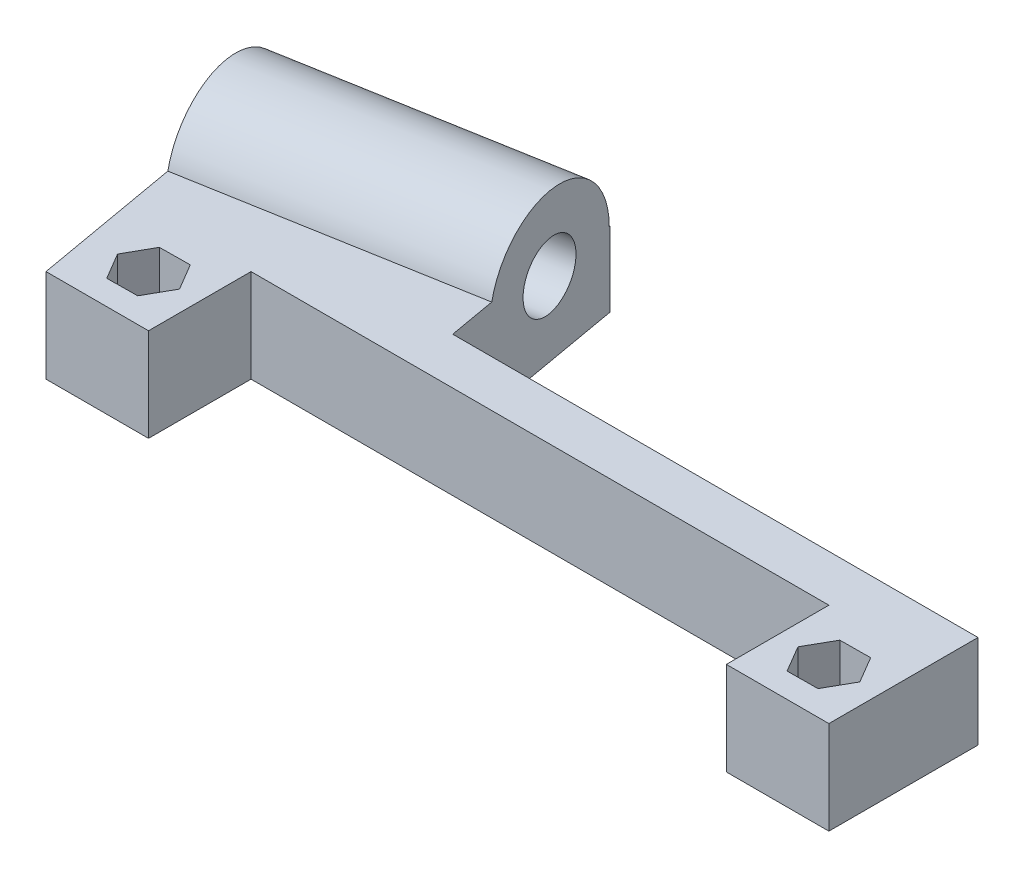
ISO-10303-21;
HEADER;
FILE_DESCRIPTION(('STEP AP214'),'2;1');
FILE_NAME('part.step','',(''),(''),'','','');
FILE_SCHEMA(('AUTOMOTIVE_DESIGN { 1 0 10303 214 1 1 1 1 }'));
ENDSEC;
DATA;
#1=APPLICATION_CONTEXT('core data for automotive mechanical design processes');
#2=APPLICATION_PROTOCOL_DEFINITION('international standard','automotive_design',2000,#1);
#3=PRODUCT_CONTEXT('',#1,'mechanical');
#4=PRODUCT('Part','Part','',(#3));
#5=PRODUCT_RELATED_PRODUCT_CATEGORY('part','',(#4));
#6=PRODUCT_DEFINITION_FORMATION('','',#4);
#7=PRODUCT_DEFINITION_CONTEXT('part definition',#1,'design');
#8=PRODUCT_DEFINITION('design','',#6,#7);
#9=PRODUCT_DEFINITION_SHAPE('','',#8);
#10=(LENGTH_UNIT() NAMED_UNIT(*) SI_UNIT(.MILLI.,.METRE.));
#11=(NAMED_UNIT(*) PLANE_ANGLE_UNIT() SI_UNIT($,.RADIAN.));
#12=(NAMED_UNIT(*) SI_UNIT($,.STERADIAN.) SOLID_ANGLE_UNIT());
#13=UNCERTAINTY_MEASURE_WITH_UNIT(LENGTH_MEASURE(1.E-05),#10,'distance_accuracy_value','');
#14=(GEOMETRIC_REPRESENTATION_CONTEXT(3) GLOBAL_UNCERTAINTY_ASSIGNED_CONTEXT((#13)) GLOBAL_UNIT_ASSIGNED_CONTEXT((#10,
#11,#12)) REPRESENTATION_CONTEXT('',''));
#15=CARTESIAN_POINT('',(0.,0.,0.));
#16=DIRECTION('',(0.,0.,1.));
#17=DIRECTION('',(1.,0.,0.));
#18=AXIS2_PLACEMENT_3D('',#15,#16,#17);
#19=CARTESIAN_POINT('',(-51.4735950712843,8.,-16.9529624797118));
#20=DIRECTION('',(0.984807753012208,0.,-0.173648177666931));
#21=DIRECTION('',(-0.173648177666931,0.,-0.984807753012208));
#22=AXIS2_PLACEMENT_3D('',#19,#20,#21);
#23=CYLINDRICAL_SURFACE('',#22,3.5);
#24=CARTESIAN_POINT('',(-16.581044211163,8.,-23.1054606220935));
#25=DIRECTION('',(0.984807753012208,0.,-0.173648177666931));
#26=DIRECTION('',(-0.173648177666931,0.,-0.984807753012208));
#27=AXIS2_PLACEMENT_3D('',#24,#25,#26);
#28=CIRCLE('',#27,3.5);
#29=CARTESIAN_POINT('',(-17.1888128329973,8.,-26.5522877576363));
#30=VERTEX_POINT('',#29);
#31=EDGE_CURVE('E402',#30,#30,#28,.T.);
#32=ORIENTED_EDGE('',*,*,#31,.T.);
#33=EDGE_LOOP('',(#32));
#34=FACE_BOUND('',#33,.T.);
#35=CARTESIAN_POINT('',(-22.4899604956478,8.,-22.0635592543912));
#36=DIRECTION('',(-0.984807753012208,0.,0.17364817766693));
#37=DIRECTION('',(0.17364817766693,0.,0.984807753012208));
#38=AXIS2_PLACEMENT_3D('',#35,#36,#37);
#39=CIRCLE('',#38,3.5);
#40=CARTESIAN_POINT('',(-21.8821918738135,8.,-18.6167321188485));
#41=VERTEX_POINT('',#40);
#42=EDGE_CURVE('E41',#41,#41,#39,.F.);
#43=ORIENTED_EDGE('',*,*,#42,.F.);
#44=EDGE_LOOP('',(#43));
#45=FACE_BOUND('',#44,.T.);
#46=ADVANCED_FACE('F37',(#34,#45),#23,.F.);
#47=CARTESIAN_POINT('',(-42.,10.,-10.5));
#48=DIRECTION('',(0.,0.,1.));
#49=DIRECTION('',(1.,0.,0.));
#50=AXIS2_PLACEMENT_3D('',#47,#48,#49);
#51=PLANE('',#50);
#52=DIRECTION('',(0.,-1.,0.));
#53=VECTOR('',#52,1.);
#54=CARTESIAN_POINT('',(-14.3583613992298,16.,-10.5));
#55=LINE('',#54,#53);
#56=CARTESIAN_POINT('',(-14.3583613992298,10.,-10.5));
#57=VERTEX_POINT('',#56);
#58=CARTESIAN_POINT('',(-14.3583613992298,0.,-10.5));
#59=VERTEX_POINT('',#58);
#60=EDGE_CURVE('E222',#57,#59,#55,.T.);
#61=ORIENTED_EDGE('',*,*,#60,.F.);
#62=DIRECTION('',(-1.,0.,0.));
#63=VECTOR('',#62,1.);
#64=CARTESIAN_POINT('',(-42.,10.,-10.5));
#65=LINE('',#64,#63);
#66=CARTESIAN_POINT('',(42.,10.,-10.5));
#67=VERTEX_POINT('',#66);
#68=EDGE_CURVE('E340',#67,#57,#65,.T.);
#69=ORIENTED_EDGE('',*,*,#68,.F.);
#70=DIRECTION('',(0.,-1.,0.));
#71=VECTOR('',#70,1.);
#72=CARTESIAN_POINT('',(42.,10.,-10.5));
#73=LINE('',#72,#71);
#74=CARTESIAN_POINT('',(42.,0.,-10.5));
#75=VERTEX_POINT('',#74);
#76=EDGE_CURVE('E377',#67,#75,#73,.T.);
#77=ORIENTED_EDGE('',*,*,#76,.T.);
#78=DIRECTION('',(-1.,0.,0.));
#79=VECTOR('',#78,1.);
#80=CARTESIAN_POINT('',(-42.,0.,-10.5));
#81=LINE('',#80,#79);
#82=EDGE_CURVE('E61',#75,#59,#81,.T.);
#83=ORIENTED_EDGE('',*,*,#82,.T.);
#84=EDGE_LOOP('',(#61,#69,#77,#83));
#85=FACE_BOUND('',#84,.T.);
#86=ADVANCED_FACE('F443',(#85),#51,.F.);
#87=CARTESIAN_POINT('',(36.5,0.,0.));
#88=DIRECTION('',(0.,1.,0.));
#89=DIRECTION('',(0.,0.,1.));
#90=AXIS2_PLACEMENT_3D('',#87,#88,#89);
#91=CYLINDRICAL_SURFACE('',#90,1.5);
#92=CARTESIAN_POINT('',(36.5,0.,0.));
#93=DIRECTION('',(0.,1.,0.));
#94=DIRECTION('',(0.,0.,1.));
#95=AXIS2_PLACEMENT_3D('',#92,#93,#94);
#96=CIRCLE('',#95,1.5);
#97=CARTESIAN_POINT('',(36.5,0.,1.5));
#98=VERTEX_POINT('',#97);
#99=EDGE_CURVE('E330',#98,#98,#96,.T.);
#100=ORIENTED_EDGE('',*,*,#99,.F.);
#101=EDGE_LOOP('',(#100));
#102=FACE_BOUND('',#101,.T.);
#103=CARTESIAN_POINT('',(36.5,4.,0.));
#104=DIRECTION('',(0.,1.,0.));
#105=DIRECTION('',(0.,0.,1.));
#106=AXIS2_PLACEMENT_3D('',#103,#104,#105);
#107=CIRCLE('',#106,1.5);
#108=CARTESIAN_POINT('',(36.5,4.,1.5));
#109=VERTEX_POINT('',#108);
#110=EDGE_CURVE('E333',#109,#109,#107,.F.);
#111=ORIENTED_EDGE('',*,*,#110,.F.);
#112=EDGE_LOOP('',(#111));
#113=FACE_BOUND('',#112,.T.);
#114=ADVANCED_FACE('F445',(#102,#113),#91,.F.);
#115=CARTESIAN_POINT('',(-36.5,0.,0.));
#116=DIRECTION('',(0.,1.,0.));
#117=DIRECTION('',(0.,0.,1.));
#118=AXIS2_PLACEMENT_3D('',#115,#116,#117);
#119=CYLINDRICAL_SURFACE('',#118,1.5);
#120=CARTESIAN_POINT('',(-36.5,0.,0.));
#121=DIRECTION('',(0.,1.,0.));
#122=DIRECTION('',(0.,0.,1.));
#123=AXIS2_PLACEMENT_3D('',#120,#121,#122);
#124=CIRCLE('',#123,1.5);
#125=CARTESIAN_POINT('',(-36.5,0.,1.5));
#126=VERTEX_POINT('',#125);
#127=EDGE_CURVE('E326',#126,#126,#124,.T.);
#128=ORIENTED_EDGE('',*,*,#127,.F.);
#129=EDGE_LOOP('',(#128));
#130=FACE_BOUND('',#129,.T.);
#131=CARTESIAN_POINT('',(-36.5,4.,0.));
#132=DIRECTION('',(0.,1.,0.));
#133=DIRECTION('',(0.,0.,1.));
#134=AXIS2_PLACEMENT_3D('',#131,#132,#133);
#135=CIRCLE('',#134,1.5);
#136=CARTESIAN_POINT('',(-36.5,4.,1.5));
#137=VERTEX_POINT('',#136);
#138=EDGE_CURVE('E269',#137,#137,#135,.F.);
#139=ORIENTED_EDGE('',*,*,#138,.F.);
#140=EDGE_LOOP('',(#139));
#141=FACE_BOUND('',#140,.T.);
#142=ADVANCED_FACE('F452',(#130,#141),#119,.F.);
#143=CARTESIAN_POINT('',(31.,10.,5.5));
#144=DIRECTION('',(0.,0.,-1.));
#145=DIRECTION('',(-1.,0.,0.));
#146=AXIS2_PLACEMENT_3D('',#143,#144,#145);
#147=PLANE('',#146);
#148=DIRECTION('',(1.,0.,0.));
#149=VECTOR('',#148,1.);
#150=CARTESIAN_POINT('',(31.,0.,5.5));
#151=LINE('',#150,#149);
#152=CARTESIAN_POINT('',(31.,0.,5.5));
#153=VERTEX_POINT('',#152);
#154=CARTESIAN_POINT('',(42.,0.,5.5));
#155=VERTEX_POINT('',#154);
#156=EDGE_CURVE('E329',#153,#155,#151,.T.);
#157=ORIENTED_EDGE('',*,*,#156,.T.);
#158=DIRECTION('',(0.,-1.,0.));
#159=VECTOR('',#158,1.);
#160=CARTESIAN_POINT('',(42.,10.,5.5));
#161=LINE('',#160,#159);
#162=CARTESIAN_POINT('',(42.,10.,5.5));
#163=VERTEX_POINT('',#162);
#164=EDGE_CURVE('E379',#163,#155,#161,.T.);
#165=ORIENTED_EDGE('',*,*,#164,.F.);
#166=DIRECTION('',(1.,0.,0.));
#167=VECTOR('',#166,1.);
#168=CARTESIAN_POINT('',(31.,10.,5.5));
#169=LINE('',#168,#167);
#170=CARTESIAN_POINT('',(31.,10.,5.5));
#171=VERTEX_POINT('',#170);
#172=EDGE_CURVE('E334',#171,#163,#169,.T.);
#173=ORIENTED_EDGE('',*,*,#172,.F.);
#174=DIRECTION('',(0.,-1.,0.));
#175=VECTOR('',#174,1.);
#176=CARTESIAN_POINT('',(31.,10.,5.5));
#177=LINE('',#176,#175);
#178=EDGE_CURVE('E351',#171,#153,#177,.T.);
#179=ORIENTED_EDGE('',*,*,#178,.T.);
#180=EDGE_LOOP('',(#157,#165,#173,#179));
#181=FACE_BOUND('',#180,.T.);
#182=ADVANCED_FACE('F39',(#181),#147,.F.);
#183=CARTESIAN_POINT('',(42.,10.,-10.5));
#184=DIRECTION('',(-1.,0.,0.));
#185=DIRECTION('',(0.,0.,1.));
#186=AXIS2_PLACEMENT_3D('',#183,#184,#185);
#187=PLANE('',#186);
#188=DIRECTION('',(0.,0.,-1.));
#189=VECTOR('',#188,1.);
#190=CARTESIAN_POINT('',(42.,0.,-10.5));
#191=LINE('',#190,#189);
#192=EDGE_CURVE('E354',#155,#75,#191,.T.);
#193=ORIENTED_EDGE('',*,*,#192,.T.);
#194=ORIENTED_EDGE('',*,*,#76,.F.);
#195=DIRECTION('',(0.,0.,-1.));
#196=VECTOR('',#195,1.);
#197=CARTESIAN_POINT('',(42.,10.,-5.5));
#198=LINE('',#197,#196);
#199=EDGE_CURVE('E337',#163,#67,#198,.T.);
#200=ORIENTED_EDGE('',*,*,#199,.F.);
#201=ORIENTED_EDGE('',*,*,#164,.T.);
#202=EDGE_LOOP('',(#193,#194,#200,#201));
#203=FACE_BOUND('',#202,.T.);
#204=ADVANCED_FACE('F442',(#203),#187,.F.);
#205=CARTESIAN_POINT('',(-42.,10.,5.5));
#206=DIRECTION('',(0.,0.,-1.));
#207=DIRECTION('',(-1.,0.,0.));
#208=AXIS2_PLACEMENT_3D('',#205,#206,#207);
#209=PLANE('',#208);
#210=DIRECTION('',(1.,0.,0.));
#211=VECTOR('',#210,1.);
#212=CARTESIAN_POINT('',(-42.,0.,5.5));
#213=LINE('',#212,#211);
#214=CARTESIAN_POINT('',(-42.,0.,5.5));
#215=VERTEX_POINT('',#214);
#216=CARTESIAN_POINT('',(-31.,0.,5.5));
#217=VERTEX_POINT('',#216);
#218=EDGE_CURVE('E357',#215,#217,#213,.T.);
#219=ORIENTED_EDGE('',*,*,#218,.T.);
#220=DIRECTION('',(0.,-1.,0.));
#221=VECTOR('',#220,1.);
#222=CARTESIAN_POINT('',(-31.,10.,5.5));
#223=LINE('',#222,#221);
#224=CARTESIAN_POINT('',(-31.,10.,5.5));
#225=VERTEX_POINT('',#224);
#226=EDGE_CURVE('E372',#225,#217,#223,.T.);
#227=ORIENTED_EDGE('',*,*,#226,.F.);
#228=DIRECTION('',(1.,0.,0.));
#229=VECTOR('',#228,1.);
#230=CARTESIAN_POINT('',(-42.,10.,5.5));
#231=LINE('',#230,#229);
#232=CARTESIAN_POINT('',(-42.,10.,5.5));
#233=VERTEX_POINT('',#232);
#234=EDGE_CURVE('E343',#233,#225,#231,.T.);
#235=ORIENTED_EDGE('',*,*,#234,.F.);
#236=DIRECTION('',(0.,-1.,0.));
#237=VECTOR('',#236,1.);
#238=CARTESIAN_POINT('',(-42.,10.,5.5));
#239=LINE('',#238,#237);
#240=EDGE_CURVE('E375',#233,#215,#239,.T.);
#241=ORIENTED_EDGE('',*,*,#240,.T.);
#242=EDGE_LOOP('',(#219,#227,#235,#241));
#243=FACE_BOUND('',#242,.T.);
#244=ADVANCED_FACE('F421',(#243),#209,.F.);
#245=CARTESIAN_POINT('',(-31.,10.,-5.5));
#246=DIRECTION('',(-1.,0.,0.));
#247=DIRECTION('',(0.,0.,1.));
#248=AXIS2_PLACEMENT_3D('',#245,#246,#247);
#249=PLANE('',#248);
#250=DIRECTION('',(0.,0.,-1.));
#251=VECTOR('',#250,1.);
#252=CARTESIAN_POINT('',(-31.,0.,-5.5));
#253=LINE('',#252,#251);
#254=CARTESIAN_POINT('',(-31.,0.,-5.5));
#255=VERTEX_POINT('',#254);
#256=EDGE_CURVE('E359',#217,#255,#253,.T.);
#257=ORIENTED_EDGE('',*,*,#256,.T.);
#258=DIRECTION('',(0.,-1.,0.));
#259=VECTOR('',#258,1.);
#260=CARTESIAN_POINT('',(-31.,10.,-5.5));
#261=LINE('',#260,#259);
#262=CARTESIAN_POINT('',(-31.,10.,-5.5));
#263=VERTEX_POINT('',#262);
#264=EDGE_CURVE('E369',#263,#255,#261,.T.);
#265=ORIENTED_EDGE('',*,*,#264,.F.);
#266=DIRECTION('',(0.,0.,-1.));
#267=VECTOR('',#266,1.);
#268=CARTESIAN_POINT('',(-31.,10.,-5.5));
#269=LINE('',#268,#267);
#270=EDGE_CURVE('E345',#225,#263,#269,.T.);
#271=ORIENTED_EDGE('',*,*,#270,.F.);
#272=ORIENTED_EDGE('',*,*,#226,.T.);
#273=EDGE_LOOP('',(#257,#265,#271,#272));
#274=FACE_BOUND('',#273,.T.);
#275=ADVANCED_FACE('F424',(#274),#249,.F.);
#276=CARTESIAN_POINT('',(-31.,10.,-5.5));
#277=DIRECTION('',(0.,0.,-1.));
#278=DIRECTION('',(-1.,0.,0.));
#279=AXIS2_PLACEMENT_3D('',#276,#277,#278);
#280=PLANE('',#279);
#281=DIRECTION('',(1.,0.,0.));
#282=VECTOR('',#281,1.);
#283=CARTESIAN_POINT('',(-31.,0.,-5.5));
#284=LINE('',#283,#282);
#285=CARTESIAN_POINT('',(31.,0.,-5.5));
#286=VERTEX_POINT('',#285);
#287=EDGE_CURVE('E361',#255,#286,#284,.T.);
#288=ORIENTED_EDGE('',*,*,#287,.T.);
#289=DIRECTION('',(0.,-1.,0.));
#290=VECTOR('',#289,1.);
#291=CARTESIAN_POINT('',(31.,10.,-5.5));
#292=LINE('',#291,#290);
#293=CARTESIAN_POINT('',(31.,10.,-5.5));
#294=VERTEX_POINT('',#293);
#295=EDGE_CURVE('E366',#294,#286,#292,.T.);
#296=ORIENTED_EDGE('',*,*,#295,.F.);
#297=DIRECTION('',(1.,0.,0.));
#298=VECTOR('',#297,1.);
#299=CARTESIAN_POINT('',(-31.,10.,-5.5));
#300=LINE('',#299,#298);
#301=EDGE_CURVE('E347',#263,#294,#300,.T.);
#302=ORIENTED_EDGE('',*,*,#301,.F.);
#303=ORIENTED_EDGE('',*,*,#264,.T.);
#304=EDGE_LOOP('',(#288,#296,#302,#303));
#305=FACE_BOUND('',#304,.T.);
#306=ADVANCED_FACE('F431',(#305),#280,.F.);
#307=CARTESIAN_POINT('',(31.,10.,-5.5));
#308=DIRECTION('',(1.,0.,0.));
#309=DIRECTION('',(0.,0.,-1.));
#310=AXIS2_PLACEMENT_3D('',#307,#308,#309);
#311=PLANE('',#310);
#312=DIRECTION('',(0.,0.,1.));
#313=VECTOR('',#312,1.);
#314=CARTESIAN_POINT('',(31.,0.,-5.5));
#315=LINE('',#314,#313);
#316=EDGE_CURVE('E338',#286,#153,#315,.T.);
#317=ORIENTED_EDGE('',*,*,#316,.T.);
#318=ORIENTED_EDGE('',*,*,#178,.F.);
#319=DIRECTION('',(0.,0.,1.));
#320=VECTOR('',#319,1.);
#321=CARTESIAN_POINT('',(31.,10.,-5.5));
#322=LINE('',#321,#320);
#323=EDGE_CURVE('E349',#294,#171,#322,.T.);
#324=ORIENTED_EDGE('',*,*,#323,.F.);
#325=ORIENTED_EDGE('',*,*,#295,.T.);
#326=EDGE_LOOP('',(#317,#318,#324,#325));
#327=FACE_BOUND('',#326,.T.);
#328=ADVANCED_FACE('F434',(#327),#311,.F.);
#329=CARTESIAN_POINT('',(0.,10.,0.));
#330=DIRECTION('',(0.,-1.,0.));
#331=DIRECTION('',(0.,0.,-1.));
#332=AXIS2_PLACEMENT_3D('',#329,#330,#331);
#333=PLANE('',#332);
#334=ORIENTED_EDGE('',*,*,#270,.T.);
#335=ORIENTED_EDGE('',*,*,#301,.T.);
#336=ORIENTED_EDGE('',*,*,#323,.T.);
#337=ORIENTED_EDGE('',*,*,#172,.T.);
#338=ORIENTED_EDGE('',*,*,#199,.T.);
#339=ORIENTED_EDGE('',*,*,#68,.T.);
#340=DIRECTION('',(0.173648177666931,0.,0.984807753012208));
#341=VECTOR('',#340,1.);
#342=CARTESIAN_POINT('',(-17.9702296324984,10.,-30.9839226461912));
#343=LINE('',#342,#341);
#344=CARTESIAN_POINT('',(-15.2539130910593,10.,-15.5789260284009));
#345=VERTEX_POINT('',#344);
#346=EDGE_CURVE('E207',#345,#57,#343,.T.);
#347=ORIENTED_EDGE('',*,*,#346,.F.);
#348=DIRECTION('',(0.984807753012208,0.,-0.173648177666931));
#349=VECTOR('',#348,1.);
#350=CARTESIAN_POINT('',(-50.1464639511806,10.,-9.4264278860191));
#351=LINE('',#350,#349);
#352=CARTESIAN_POINT('',(-44.7982154478371,10.,-10.3694683966922));
#353=VERTEX_POINT('',#352);
#354=EDGE_CURVE('E208',#353,#345,#351,.T.);
#355=ORIENTED_EDGE('',*,*,#354,.F.);
#356=DIRECTION('',(-0.17364817766693,0.,-0.984807753012208));
#357=VECTOR('',#356,1.);
#358=CARTESIAN_POINT('',(-42.,10.,5.5));
#359=LINE('',#358,#357);
#360=EDGE_CURVE('E11',#233,#353,#359,.T.);
#361=ORIENTED_EDGE('',*,*,#360,.F.);
#362=ORIENTED_EDGE('',*,*,#234,.T.);
#363=EDGE_LOOP('',(#334,#335,#336,#337,#338,#339,#347,#355,#361,#362));
#364=FACE_BOUND('',#363,.T.);
#365=DIRECTION('',(0.491338681577482,0.,-0.87096859873689));
#366=VECTOR('',#365,1.);
#367=CARTESIAN_POINT('',(-34.8262118758051,10.,2.8334490140647));
#368=LINE('',#367,#366);
#369=CARTESIAN_POINT('',(-34.8262118758051,10.,2.8334490140647));
#370=VERTEX_POINT('',#369);
#371=CARTESIAN_POINT('',(-33.2092671113946,10.,-0.0328185290730799));
#372=VERTEX_POINT('',#371);
#373=EDGE_CURVE('E301',#370,#372,#368,.T.);
#374=ORIENTED_EDGE('',*,*,#373,.F.);
#375=DIRECTION('',(0.999950273193423,0.,-0.00997251926039519));
#376=VECTOR('',#375,1.);
#377=CARTESIAN_POINT('',(-38.1169447644106,10.,2.86626754313778));
#378=LINE('',#377,#376);
#379=CARTESIAN_POINT('',(-38.1169447644106,10.,2.86626754313778));
#380=VERTEX_POINT('',#379);
#381=EDGE_CURVE('E224',#380,#370,#378,.T.);
#382=ORIENTED_EDGE('',*,*,#381,.F.);
#383=DIRECTION('',(0.508611591615942,0.,0.860996079476497));
#384=VECTOR('',#383,1.);
#385=CARTESIAN_POINT('',(-39.7907328886054,10.,0.0328185290730738));
#386=LINE('',#385,#384);
#387=CARTESIAN_POINT('',(-39.7907328886054,10.,0.0328185290730738));
#388=VERTEX_POINT('',#387);
#389=EDGE_CURVE('E284',#388,#380,#386,.T.);
#390=ORIENTED_EDGE('',*,*,#389,.F.);
#391=DIRECTION('',(-0.49133868157748,0.,0.870968598736891));
#392=VECTOR('',#391,1.);
#393=CARTESIAN_POINT('',(-38.1737881241948,10.,-2.83344901406471));
#394=LINE('',#393,#392);
#395=CARTESIAN_POINT('',(-38.1737881241948,10.,-2.83344901406471));
#396=VERTEX_POINT('',#395);
#397=EDGE_CURVE('E310',#396,#388,#394,.T.);
#398=ORIENTED_EDGE('',*,*,#397,.F.);
#399=DIRECTION('',(-0.999950273193423,0.,0.00997251926039532));
#400=VECTOR('',#399,1.);
#401=CARTESIAN_POINT('',(-34.8830552355894,10.,-2.86626754313779));
#402=LINE('',#401,#400);
#403=CARTESIAN_POINT('',(-34.8830552355894,10.,-2.86626754313779));
#404=VERTEX_POINT('',#403);
#405=EDGE_CURVE('E307',#404,#396,#402,.T.);
#406=ORIENTED_EDGE('',*,*,#405,.F.);
#407=DIRECTION('',(-0.508611591615944,0.,-0.860996079476496));
#408=VECTOR('',#407,1.);
#409=CARTESIAN_POINT('',(-33.2092671113946,10.,-0.0328185290730799));
#410=LINE('',#409,#408);
#411=EDGE_CURVE('E304',#372,#404,#410,.T.);
#412=ORIENTED_EDGE('',*,*,#411,.F.);
#413=EDGE_LOOP('',(#374,#382,#390,#398,#406,#412));
#414=FACE_BOUND('',#413,.T.);
#415=DIRECTION('',(0.492912990642068,0.,-0.870078607745469));
#416=VECTOR('',#415,1.);
#417=CARTESIAN_POINT('',(38.168661205747,10.,2.83647136076414));
#418=LINE('',#417,#416);
#419=CARTESIAN_POINT('',(38.168661205747,10.,2.83647136076414));
#420=VERTEX_POINT('',#419);
#421=CARTESIAN_POINT('',(39.7907868584022,10.,-0.0268673141043556));
#422=VERTEX_POINT('',#421);
#423=EDGE_CURVE('E252',#420,#422,#418,.T.);
#424=ORIENTED_EDGE('',*,*,#423,.F.);
#425=DIRECTION('',(0.999966672918006,0.,-0.00816413212134351));
#426=VECTOR('',#425,1.);
#427=CARTESIAN_POINT('',(34.8778743473447,10.,2.8633386748685));
#428=LINE('',#427,#426);
#429=CARTESIAN_POINT('',(34.8778743473447,10.,2.8633386748685));
#430=VERTEX_POINT('',#429);
#431=EDGE_CURVE('E250',#430,#420,#428,.T.);
#432=ORIENTED_EDGE('',*,*,#431,.F.);
#433=DIRECTION('',(0.507053682275939,0.,0.861914475624125));
#434=VECTOR('',#433,1.);
#435=CARTESIAN_POINT('',(33.2092131415978,10.,0.0268673141043597));
#436=LINE('',#435,#434);
#437=CARTESIAN_POINT('',(33.2092131415978,10.,0.0268673141043597));
#438=VERTEX_POINT('',#437);
#439=EDGE_CURVE('E234',#438,#430,#436,.T.);
#440=ORIENTED_EDGE('',*,*,#439,.F.);
#441=DIRECTION('',(-0.492912990642066,0.,0.870078607745469));
#442=VECTOR('',#441,1.);
#443=CARTESIAN_POINT('',(34.8313387942531,10.,-2.83647136076415));
#444=LINE('',#443,#442);
#445=CARTESIAN_POINT('',(34.8313387942531,10.,-2.83647136076415));
#446=VERTEX_POINT('',#445);
#447=EDGE_CURVE('E262',#446,#438,#444,.T.);
#448=ORIENTED_EDGE('',*,*,#447,.F.);
#449=DIRECTION('',(-0.999966672918006,0.,0.0081641321213434));
#450=VECTOR('',#449,1.);
#451=CARTESIAN_POINT('',(38.1221256526553,10.,-2.86333867486851));
#452=LINE('',#451,#450);
#453=CARTESIAN_POINT('',(38.1221256526553,10.,-2.86333867486851));
#454=VERTEX_POINT('',#453);
#455=EDGE_CURVE('E259',#454,#446,#452,.T.);
#456=ORIENTED_EDGE('',*,*,#455,.F.);
#457=DIRECTION('',(-0.50705368227594,0.,-0.861914475624125));
#458=VECTOR('',#457,1.);
#459=CARTESIAN_POINT('',(39.7907868584022,10.,-0.0268673141043556));
#460=LINE('',#459,#458);
#461=EDGE_CURVE('E256',#422,#454,#460,.T.);
#462=ORIENTED_EDGE('',*,*,#461,.F.);
#463=EDGE_LOOP('',(#424,#432,#440,#448,#456,#462));
#464=FACE_BOUND('',#463,.T.);
#465=ADVANCED_FACE('F397',(#364,#414,#464),#333,.F.);
#466=CARTESIAN_POINT('',(0.,0.,0.));
#467=DIRECTION('',(0.,-1.,0.));
#468=DIRECTION('',(0.,0.,-1.));
#469=AXIS2_PLACEMENT_3D('',#466,#467,#468);
#470=PLANE('',#469);
#471=ORIENTED_EDGE('',*,*,#218,.F.);
#472=DIRECTION('',(0.17364817766693,0.,0.984807753012208));
#473=VECTOR('',#472,1.);
#474=CARTESIAN_POINT('',(-42.,0.,5.5));
#475=LINE('',#474,#473);
#476=CARTESIAN_POINT('',(-47.5145319892762,0.,-25.7744650144826));
#477=VERTEX_POINT('',#476);
#478=EDGE_CURVE('E226',#477,#215,#475,.T.);
#479=ORIENTED_EDGE('',*,*,#478,.F.);
#480=DIRECTION('',(-0.984807753012208,0.,0.173648177666929));
#481=VECTOR('',#480,1.);
#482=CARTESIAN_POINT('',(-44.7783708426709,0.,-26.2569240481953));
#483=LINE('',#482,#481);
#484=CARTESIAN_POINT('',(-17.9702296324984,0.,-30.9839226461912));
#485=VERTEX_POINT('',#484);
#486=EDGE_CURVE('E410',#485,#477,#483,.T.);
#487=ORIENTED_EDGE('',*,*,#486,.F.);
#488=DIRECTION('',(-0.173648177666931,0.,-0.984807753012208));
#489=VECTOR('',#488,1.);
#490=CARTESIAN_POINT('',(-17.9702296324984,0.,-30.9839226461912));
#491=LINE('',#490,#489);
#492=EDGE_CURVE('E221',#59,#485,#491,.T.);
#493=ORIENTED_EDGE('',*,*,#492,.F.);
#494=ORIENTED_EDGE('',*,*,#82,.F.);
#495=ORIENTED_EDGE('',*,*,#192,.F.);
#496=ORIENTED_EDGE('',*,*,#156,.F.);
#497=ORIENTED_EDGE('',*,*,#316,.F.);
#498=ORIENTED_EDGE('',*,*,#287,.F.);
#499=ORIENTED_EDGE('',*,*,#256,.F.);
#500=EDGE_LOOP('',(#471,#479,#487,#493,#494,#495,#496,#497,#498,#499));
#501=FACE_BOUND('',#500,.T.);
#502=ORIENTED_EDGE('',*,*,#127,.T.);
#503=EDGE_LOOP('',(#502));
#504=FACE_BOUND('',#503,.T.);
#505=ORIENTED_EDGE('',*,*,#99,.T.);
#506=EDGE_LOOP('',(#505));
#507=FACE_BOUND('',#506,.T.);
#508=ADVANCED_FACE('F415',(#501,#504,#507),#470,.T.);
#509=CARTESIAN_POINT('',(0.,4.,0.));
#510=DIRECTION('',(0.,1.,0.));
#511=DIRECTION('',(0.,0.,1.));
#512=AXIS2_PLACEMENT_3D('',#509,#510,#511);
#513=PLANE('',#512);
#514=DIRECTION('',(0.999950273193423,0.,-0.00997251926039519));
#515=VECTOR('',#514,1.);
#516=CARTESIAN_POINT('',(-38.1169447644106,4.,2.86626754313778));
#517=LINE('',#516,#515);
#518=CARTESIAN_POINT('',(-38.1169447644106,4.,2.86626754313778));
#519=VERTEX_POINT('',#518);
#520=CARTESIAN_POINT('',(-34.8262118758051,4.,2.8334490140647));
#521=VERTEX_POINT('',#520);
#522=EDGE_CURVE('E280',#519,#521,#517,.T.);
#523=ORIENTED_EDGE('',*,*,#522,.T.);
#524=DIRECTION('',(0.491338681577482,0.,-0.87096859873689));
#525=VECTOR('',#524,1.);
#526=CARTESIAN_POINT('',(-34.8262118758051,4.,2.8334490140647));
#527=LINE('',#526,#525);
#528=CARTESIAN_POINT('',(-33.2092671113946,4.,-0.0328185290730799));
#529=VERTEX_POINT('',#528);
#530=EDGE_CURVE('E283',#521,#529,#527,.T.);
#531=ORIENTED_EDGE('',*,*,#530,.T.);
#532=DIRECTION('',(-0.508611591615944,0.,-0.860996079476496));
#533=VECTOR('',#532,1.);
#534=CARTESIAN_POINT('',(-33.2092671113946,4.,-0.0328185290730799));
#535=LINE('',#534,#533);
#536=CARTESIAN_POINT('',(-34.8830552355894,4.,-2.86626754313779));
#537=VERTEX_POINT('',#536);
#538=EDGE_CURVE('E287',#529,#537,#535,.T.);
#539=ORIENTED_EDGE('',*,*,#538,.T.);
#540=DIRECTION('',(-0.999950273193423,0.,0.00997251926039532));
#541=VECTOR('',#540,1.);
#542=CARTESIAN_POINT('',(-34.8830552355894,4.,-2.86626754313779));
#543=LINE('',#542,#541);
#544=CARTESIAN_POINT('',(-38.1737881241948,4.,-2.83344901406471));
#545=VERTEX_POINT('',#544);
#546=EDGE_CURVE('E290',#537,#545,#543,.T.);
#547=ORIENTED_EDGE('',*,*,#546,.T.);
#548=DIRECTION('',(-0.49133868157748,0.,0.870968598736891));
#549=VECTOR('',#548,1.);
#550=CARTESIAN_POINT('',(-38.1737881241948,4.,-2.83344901406471));
#551=LINE('',#550,#549);
#552=CARTESIAN_POINT('',(-39.7907328886054,4.,0.0328185290730738));
#553=VERTEX_POINT('',#552);
#554=EDGE_CURVE('E293',#545,#553,#551,.T.);
#555=ORIENTED_EDGE('',*,*,#554,.T.);
#556=DIRECTION('',(0.508611591615942,0.,0.860996079476497));
#557=VECTOR('',#556,1.);
#558=CARTESIAN_POINT('',(-39.7907328886054,4.,0.0328185290730738));
#559=LINE('',#558,#557);
#560=EDGE_CURVE('E296',#553,#519,#559,.T.);
#561=ORIENTED_EDGE('',*,*,#560,.T.);
#562=EDGE_LOOP('',(#523,#531,#539,#547,#555,#561));
#563=FACE_BOUND('',#562,.T.);
#564=ORIENTED_EDGE('',*,*,#138,.T.);
#565=EDGE_LOOP('',(#564));
#566=FACE_BOUND('',#565,.T.);
#567=ADVANCED_FACE('F482',(#563,#566),#513,.T.);
#568=CARTESIAN_POINT('',(-38.1169447644106,4.,2.86626754313778));
#569=DIRECTION('',(0.00997251926039519,0.,0.999950273193423));
#570=DIRECTION('',(0.999950273193423,0.,-0.00997251926039519));
#571=AXIS2_PLACEMENT_3D('',#568,#569,#570);
#572=PLANE('',#571);
#573=ORIENTED_EDGE('',*,*,#381,.T.);
#574=DIRECTION('',(0.,1.,0.));
#575=VECTOR('',#574,1.);
#576=CARTESIAN_POINT('',(-34.8262118758051,4.,2.8334490140647));
#577=LINE('',#576,#575);
#578=EDGE_CURVE('E299',#521,#370,#577,.T.);
#579=ORIENTED_EDGE('',*,*,#578,.F.);
#580=ORIENTED_EDGE('',*,*,#522,.F.);
#581=DIRECTION('',(0.,1.,0.));
#582=VECTOR('',#581,1.);
#583=CARTESIAN_POINT('',(-38.1169447644106,4.,2.86626754313778));
#584=LINE('',#583,#582);
#585=EDGE_CURVE('E253',#519,#380,#584,.T.);
#586=ORIENTED_EDGE('',*,*,#585,.T.);
#587=EDGE_LOOP('',(#573,#579,#580,#586));
#588=FACE_BOUND('',#587,.T.);
#589=ADVANCED_FACE('F475',(#588),#572,.F.);
#590=CARTESIAN_POINT('',(-39.7907328886054,4.,0.0328185290730738));
#591=DIRECTION('',(-0.860996079476497,0.,0.508611591615942));
#592=DIRECTION('',(0.508611591615942,0.,0.860996079476497));
#593=AXIS2_PLACEMENT_3D('',#590,#591,#592);
#594=PLANE('',#593);
#595=ORIENTED_EDGE('',*,*,#389,.T.);
#596=ORIENTED_EDGE('',*,*,#585,.F.);
#597=ORIENTED_EDGE('',*,*,#560,.F.);
#598=DIRECTION('',(0.,1.,0.));
#599=VECTOR('',#598,1.);
#600=CARTESIAN_POINT('',(-39.7907328886054,4.,0.0328185290730738));
#601=LINE('',#600,#599);
#602=EDGE_CURVE('E316',#553,#388,#601,.T.);
#603=ORIENTED_EDGE('',*,*,#602,.T.);
#604=EDGE_LOOP('',(#595,#596,#597,#603));
#605=FACE_BOUND('',#604,.T.);
#606=ADVANCED_FACE('F610',(#605),#594,.F.);
#607=CARTESIAN_POINT('',(-38.1737881241948,4.,-2.83344901406471));
#608=DIRECTION('',(-0.870968598736891,0.,-0.49133868157748));
#609=DIRECTION('',(-0.49133868157748,0.,0.870968598736891));
#610=AXIS2_PLACEMENT_3D('',#607,#608,#609);
#611=PLANE('',#610);
#612=ORIENTED_EDGE('',*,*,#397,.T.);
#613=ORIENTED_EDGE('',*,*,#602,.F.);
#614=ORIENTED_EDGE('',*,*,#554,.F.);
#615=DIRECTION('',(0.,1.,0.));
#616=VECTOR('',#615,1.);
#617=CARTESIAN_POINT('',(-38.1737881241948,4.,-2.83344901406471));
#618=LINE('',#617,#616);
#619=EDGE_CURVE('E318',#545,#396,#618,.T.);
#620=ORIENTED_EDGE('',*,*,#619,.T.);
#621=EDGE_LOOP('',(#612,#613,#614,#620));
#622=FACE_BOUND('',#621,.T.);
#623=ADVANCED_FACE('F613',(#622),#611,.F.);
#624=CARTESIAN_POINT('',(-34.8830552355894,4.,-2.86626754313779));
#625=DIRECTION('',(-0.00997251926039532,0.,-0.999950273193423));
#626=DIRECTION('',(-0.999950273193423,0.,0.00997251926039532));
#627=AXIS2_PLACEMENT_3D('',#624,#625,#626);
#628=PLANE('',#627);
#629=ORIENTED_EDGE('',*,*,#405,.T.);
#630=ORIENTED_EDGE('',*,*,#619,.F.);
#631=ORIENTED_EDGE('',*,*,#546,.F.);
#632=DIRECTION('',(0.,1.,0.));
#633=VECTOR('',#632,1.);
#634=CARTESIAN_POINT('',(-34.8830552355894,4.,-2.86626754313779));
#635=LINE('',#634,#633);
#636=EDGE_CURVE('E320',#537,#404,#635,.T.);
#637=ORIENTED_EDGE('',*,*,#636,.T.);
#638=EDGE_LOOP('',(#629,#630,#631,#637));
#639=FACE_BOUND('',#638,.T.);
#640=ADVANCED_FACE('F617',(#639),#628,.F.);
#641=CARTESIAN_POINT('',(-33.2092671113946,4.,-0.0328185290730799));
#642=DIRECTION('',(0.860996079476496,0.,-0.508611591615944));
#643=DIRECTION('',(-0.508611591615944,0.,-0.860996079476496));
#644=AXIS2_PLACEMENT_3D('',#641,#642,#643);
#645=PLANE('',#644);
#646=ORIENTED_EDGE('',*,*,#411,.T.);
#647=ORIENTED_EDGE('',*,*,#636,.F.);
#648=ORIENTED_EDGE('',*,*,#538,.F.);
#649=DIRECTION('',(0.,1.,0.));
#650=VECTOR('',#649,1.);
#651=CARTESIAN_POINT('',(-33.2092671113946,4.,-0.0328185290730799));
#652=LINE('',#651,#650);
#653=EDGE_CURVE('E322',#529,#372,#652,.T.);
#654=ORIENTED_EDGE('',*,*,#653,.T.);
#655=EDGE_LOOP('',(#646,#647,#648,#654));
#656=FACE_BOUND('',#655,.T.);
#657=ADVANCED_FACE('F621',(#656),#645,.F.);
#658=CARTESIAN_POINT('',(-34.8262118758051,4.,2.8334490140647));
#659=DIRECTION('',(0.87096859873689,0.,0.491338681577481));
#660=DIRECTION('',(0.491338681577482,0.,-0.87096859873689));
#661=AXIS2_PLACEMENT_3D('',#658,#659,#660);
#662=PLANE('',#661);
#663=ORIENTED_EDGE('',*,*,#373,.T.);
#664=ORIENTED_EDGE('',*,*,#653,.F.);
#665=ORIENTED_EDGE('',*,*,#530,.F.);
#666=ORIENTED_EDGE('',*,*,#578,.T.);
#667=EDGE_LOOP('',(#663,#664,#665,#666));
#668=FACE_BOUND('',#667,.T.);
#669=ADVANCED_FACE('F583',(#668),#662,.F.);
#670=CARTESIAN_POINT('',(0.,4.,0.));
#671=DIRECTION('',(0.,1.,0.));
#672=DIRECTION('',(0.,0.,1.));
#673=AXIS2_PLACEMENT_3D('',#670,#671,#672);
#674=PLANE('',#673);
#675=DIRECTION('',(0.999966672918006,0.,-0.00816413212134351));
#676=VECTOR('',#675,1.);
#677=CARTESIAN_POINT('',(34.8778743473447,4.,2.8633386748685));
#678=LINE('',#677,#676);
#679=CARTESIAN_POINT('',(34.8778743473447,4.,2.8633386748685));
#680=VERTEX_POINT('',#679);
#681=CARTESIAN_POINT('',(38.168661205747,4.,2.83647136076414));
#682=VERTEX_POINT('',#681);
#683=EDGE_CURVE('E230',#680,#682,#678,.T.);
#684=ORIENTED_EDGE('',*,*,#683,.T.);
#685=DIRECTION('',(0.492912990642068,0.,-0.870078607745469));
#686=VECTOR('',#685,1.);
#687=CARTESIAN_POINT('',(38.168661205747,4.,2.83647136076414));
#688=LINE('',#687,#686);
#689=CARTESIAN_POINT('',(39.7907868584022,4.,-0.0268673141043556));
#690=VERTEX_POINT('',#689);
#691=EDGE_CURVE('E233',#682,#690,#688,.T.);
#692=ORIENTED_EDGE('',*,*,#691,.T.);
#693=DIRECTION('',(-0.50705368227594,0.,-0.861914475624125));
#694=VECTOR('',#693,1.);
#695=CARTESIAN_POINT('',(39.7907868584022,4.,-0.0268673141043556));
#696=LINE('',#695,#694);
#697=CARTESIAN_POINT('',(38.1221256526553,4.,-2.86333867486851));
#698=VERTEX_POINT('',#697);
#699=EDGE_CURVE('E237',#690,#698,#696,.T.);
#700=ORIENTED_EDGE('',*,*,#699,.T.);
#701=DIRECTION('',(-0.999966672918006,0.,0.0081641321213434));
#702=VECTOR('',#701,1.);
#703=CARTESIAN_POINT('',(38.1221256526553,4.,-2.86333867486851));
#704=LINE('',#703,#702);
#705=CARTESIAN_POINT('',(34.8313387942531,4.,-2.83647136076415));
#706=VERTEX_POINT('',#705);
#707=EDGE_CURVE('E240',#698,#706,#704,.T.);
#708=ORIENTED_EDGE('',*,*,#707,.T.);
#709=DIRECTION('',(-0.492912990642066,0.,0.870078607745469));
#710=VECTOR('',#709,1.);
#711=CARTESIAN_POINT('',(34.8313387942531,4.,-2.83647136076415));
#712=LINE('',#711,#710);
#713=CARTESIAN_POINT('',(33.2092131415978,4.,0.0268673141043597));
#714=VERTEX_POINT('',#713);
#715=EDGE_CURVE('E243',#706,#714,#712,.T.);
#716=ORIENTED_EDGE('',*,*,#715,.T.);
#717=DIRECTION('',(0.507053682275939,0.,0.861914475624125));
#718=VECTOR('',#717,1.);
#719=CARTESIAN_POINT('',(33.2092131415978,4.,0.0268673141043597));
#720=LINE('',#719,#718);
#721=EDGE_CURVE('E246',#714,#680,#720,.T.);
#722=ORIENTED_EDGE('',*,*,#721,.T.);
#723=EDGE_LOOP('',(#684,#692,#700,#708,#716,#722));
#724=FACE_BOUND('',#723,.T.);
#725=ORIENTED_EDGE('',*,*,#110,.T.);
#726=EDGE_LOOP('',(#725));
#727=FACE_BOUND('',#726,.T.);
#728=ADVANCED_FACE('F579',(#724,#727),#674,.T.);
#729=CARTESIAN_POINT('',(34.8778743473447,4.,2.8633386748685));
#730=DIRECTION('',(0.00816413212134351,0.,0.999966672918005));
#731=DIRECTION('',(0.999966672918006,0.,-0.00816413212134351));
#732=AXIS2_PLACEMENT_3D('',#729,#730,#731);
#733=PLANE('',#732);
#734=ORIENTED_EDGE('',*,*,#431,.T.);
#735=DIRECTION('',(0.,1.,0.));
#736=VECTOR('',#735,1.);
#737=CARTESIAN_POINT('',(38.168661205747,4.,2.83647136076414));
#738=LINE('',#737,#736);
#739=EDGE_CURVE('E249',#682,#420,#738,.T.);
#740=ORIENTED_EDGE('',*,*,#739,.F.);
#741=ORIENTED_EDGE('',*,*,#683,.F.);
#742=DIRECTION('',(0.,1.,0.));
#743=VECTOR('',#742,1.);
#744=CARTESIAN_POINT('',(34.8778743473447,4.,2.8633386748685));
#745=LINE('',#744,#743);
#746=EDGE_CURVE('E267',#680,#430,#745,.T.);
#747=ORIENTED_EDGE('',*,*,#746,.T.);
#748=EDGE_LOOP('',(#734,#740,#741,#747));
#749=FACE_BOUND('',#748,.T.);
#750=ADVANCED_FACE('F582',(#749),#733,.F.);
#751=CARTESIAN_POINT('',(33.2092131415978,4.,0.0268673141043597));
#752=DIRECTION('',(-0.861914475624125,0.,0.507053682275939));
#753=DIRECTION('',(0.507053682275939,0.,0.861914475624125));
#754=AXIS2_PLACEMENT_3D('',#751,#752,#753);
#755=PLANE('',#754);
#756=ORIENTED_EDGE('',*,*,#439,.T.);
#757=ORIENTED_EDGE('',*,*,#746,.F.);
#758=ORIENTED_EDGE('',*,*,#721,.F.);
#759=DIRECTION('',(0.,1.,0.));
#760=VECTOR('',#759,1.);
#761=CARTESIAN_POINT('',(33.2092131415978,4.,0.0268673141043597));
#762=LINE('',#761,#760);
#763=EDGE_CURVE('E270',#714,#438,#762,.T.);
#764=ORIENTED_EDGE('',*,*,#763,.T.);
#765=EDGE_LOOP('',(#756,#757,#758,#764));
#766=FACE_BOUND('',#765,.T.);
#767=ADVANCED_FACE('F585',(#766),#755,.F.);
#768=CARTESIAN_POINT('',(34.8313387942531,4.,-2.83647136076415));
#769=DIRECTION('',(-0.870078607745469,0.,-0.492912990642066));
#770=DIRECTION('',(-0.492912990642066,0.,0.87007860774547));
#771=AXIS2_PLACEMENT_3D('',#768,#769,#770);
#772=PLANE('',#771);
#773=ORIENTED_EDGE('',*,*,#447,.T.);
#774=ORIENTED_EDGE('',*,*,#763,.F.);
#775=ORIENTED_EDGE('',*,*,#715,.F.);
#776=DIRECTION('',(0.,1.,0.));
#777=VECTOR('',#776,1.);
#778=CARTESIAN_POINT('',(34.8313387942531,4.,-2.83647136076415));
#779=LINE('',#778,#777);
#780=EDGE_CURVE('E272',#706,#446,#779,.T.);
#781=ORIENTED_EDGE('',*,*,#780,.T.);
#782=EDGE_LOOP('',(#773,#774,#775,#781));
#783=FACE_BOUND('',#782,.T.);
#784=ADVANCED_FACE('F588',(#783),#772,.F.);
#785=CARTESIAN_POINT('',(38.1221256526553,4.,-2.86333867486851));
#786=DIRECTION('',(-0.00816413212134339,0.,-0.999966672918005));
#787=DIRECTION('',(-0.999966672918006,0.,0.0081641321213434));
#788=AXIS2_PLACEMENT_3D('',#785,#786,#787);
#789=PLANE('',#788);
#790=ORIENTED_EDGE('',*,*,#455,.T.);
#791=ORIENTED_EDGE('',*,*,#780,.F.);
#792=ORIENTED_EDGE('',*,*,#707,.F.);
#793=DIRECTION('',(0.,1.,0.));
#794=VECTOR('',#793,1.);
#795=CARTESIAN_POINT('',(38.1221256526553,4.,-2.86333867486851));
#796=LINE('',#795,#794);
#797=EDGE_CURVE('E274',#698,#454,#796,.T.);
#798=ORIENTED_EDGE('',*,*,#797,.T.);
#799=EDGE_LOOP('',(#790,#791,#792,#798));
#800=FACE_BOUND('',#799,.T.);
#801=ADVANCED_FACE('F592',(#800),#789,.F.);
#802=CARTESIAN_POINT('',(39.7907868584022,4.,-0.0268673141043556));
#803=DIRECTION('',(0.861914475624125,0.,-0.507053682275939));
#804=DIRECTION('',(-0.50705368227594,0.,-0.861914475624125));
#805=AXIS2_PLACEMENT_3D('',#802,#803,#804);
#806=PLANE('',#805);
#807=ORIENTED_EDGE('',*,*,#461,.T.);
#808=ORIENTED_EDGE('',*,*,#797,.F.);
#809=ORIENTED_EDGE('',*,*,#699,.F.);
#810=DIRECTION('',(0.,1.,0.));
#811=VECTOR('',#810,1.);
#812=CARTESIAN_POINT('',(39.7907868584022,4.,-0.0268673141043556));
#813=LINE('',#812,#811);
#814=EDGE_CURVE('E276',#690,#422,#813,.T.);
#815=ORIENTED_EDGE('',*,*,#814,.T.);
#816=EDGE_LOOP('',(#807,#808,#809,#815));
#817=FACE_BOUND('',#816,.T.);
#818=ADVANCED_FACE('F596',(#817),#806,.F.);
#819=CARTESIAN_POINT('',(38.168661205747,4.,2.83647136076414));
#820=DIRECTION('',(0.870078607745468,0.,0.492912990642068));
#821=DIRECTION('',(0.492912990642068,0.,-0.870078607745469));
#822=AXIS2_PLACEMENT_3D('',#819,#820,#821);
#823=PLANE('',#822);
#824=ORIENTED_EDGE('',*,*,#423,.T.);
#825=ORIENTED_EDGE('',*,*,#814,.F.);
#826=ORIENTED_EDGE('',*,*,#691,.F.);
#827=ORIENTED_EDGE('',*,*,#739,.T.);
#828=EDGE_LOOP('',(#824,#825,#826,#827));
#829=FACE_BOUND('',#828,.T.);
#830=ADVANCED_FACE('F539',(#829),#823,.F.);
#831=CARTESIAN_POINT('',(-17.9702296324984,16.,-30.9839226461912));
#832=DIRECTION('',(-0.984807753012208,0.,0.173648177666931));
#833=DIRECTION('',(0.173648177666931,0.,0.984807753012208));
#834=AXIS2_PLACEMENT_3D('',#831,#832,#833);
#835=PLANE('',#834);
#836=ORIENTED_EDGE('',*,*,#31,.F.);
#837=EDGE_LOOP('',(#836));
#838=FACE_BOUND('',#837,.T.);
#839=CARTESIAN_POINT('',(-16.581044211163,8.,-23.1054606220935));
#840=DIRECTION('',(-0.984807753012208,0.,0.173648177666931));
#841=DIRECTION('',(0.173648177666931,0.,0.984807753012208));
#842=AXIS2_PLACEMENT_3D('',#839,#840,#841);
#843=CIRCLE('',#842,7.9);
#844=CARTESIAN_POINT('',(-17.9528648147318,8.,-30.88544187089));
#845=VERTEX_POINT('',#844);
#846=EDGE_CURVE('E407',#845,#345,#843,.F.);
#847=ORIENTED_EDGE('',*,*,#846,.T.);
#848=ORIENTED_EDGE('',*,*,#346,.T.);
#849=ORIENTED_EDGE('',*,*,#60,.T.);
#850=ORIENTED_EDGE('',*,*,#492,.T.);
#851=DIRECTION('',(0.,-1.,0.));
#852=VECTOR('',#851,1.);
#853=CARTESIAN_POINT('',(-17.9702296324984,16.,-30.9839226461912));
#854=LINE('',#853,#852);
#855=CARTESIAN_POINT('',(-17.9702296324984,8.,-30.9839226461912));
#856=VERTEX_POINT('',#855);
#857=EDGE_CURVE('E214',#856,#485,#854,.T.);
#858=ORIENTED_EDGE('',*,*,#857,.F.);
#859=DIRECTION('',(0.173648177666931,0.,0.984807753012208));
#860=VECTOR('',#859,1.);
#861=CARTESIAN_POINT('',(-17.9702296324984,8.,-30.9839226461912));
#862=LINE('',#861,#860);
#863=EDGE_CURVE('E200',#856,#845,#862,.T.);
#864=ORIENTED_EDGE('',*,*,#863,.T.);
#865=EDGE_LOOP('',(#847,#848,#849,#850,#858,#864));
#866=FACE_BOUND('',#865,.T.);
#867=ADVANCED_FACE('F219',(#838,#866),#835,.F.);
#868=CARTESIAN_POINT('',(-44.7783708426709,16.,-26.2569240481953));
#869=DIRECTION('',(0.173648177666929,0.,0.984807753012208));
#870=DIRECTION('',(0.984807753012208,0.,-0.173648177666929));
#871=AXIS2_PLACEMENT_3D('',#868,#869,#870);
#872=PLANE('',#871);
#873=DIRECTION('',(0.,-1.,0.));
#874=VECTOR('',#873,1.);
#875=CARTESIAN_POINT('',(-47.5145319892762,16.,-25.7744650144826));
#876=LINE('',#875,#874);
#877=CARTESIAN_POINT('',(-47.5145319892762,8.,-25.7744650144826));
#878=VERTEX_POINT('',#877);
#879=EDGE_CURVE('E216',#878,#477,#876,.T.);
#880=ORIENTED_EDGE('',*,*,#879,.F.);
#881=DIRECTION('',(0.984807753012208,0.,-0.173648177666931));
#882=VECTOR('',#881,1.);
#883=CARTESIAN_POINT('',(-52.8627804926197,8.,-24.8314245038094));
#884=LINE('',#883,#882);
#885=EDGE_CURVE('E53',#878,#856,#884,.T.);
#886=ORIENTED_EDGE('',*,*,#885,.T.);
#887=ORIENTED_EDGE('',*,*,#857,.T.);
#888=ORIENTED_EDGE('',*,*,#486,.T.);
#889=EDGE_LOOP('',(#880,#886,#887,#888));
#890=FACE_BOUND('',#889,.T.);
#891=ADVANCED_FACE('F212',(#890),#872,.F.);
#892=CARTESIAN_POINT('',(-42.,16.,5.5));
#893=DIRECTION('',(0.984807753012208,0.,-0.17364817766693));
#894=DIRECTION('',(-0.17364817766693,0.,-0.984807753012208));
#895=AXIS2_PLACEMENT_3D('',#892,#893,#894);
#896=PLANE('',#895);
#897=CARTESIAN_POINT('',(-46.1253465679408,8.,-17.8960029903849));
#898=DIRECTION('',(-0.984807753012208,0.,0.17364817766693));
#899=DIRECTION('',(0.17364817766693,0.,0.984807753012208));
#900=AXIS2_PLACEMENT_3D('',#897,#898,#899);
#901=CIRCLE('',#900,5.25);
#902=CARTESIAN_POINT('',(-45.2136936351894,8.,-12.7257622870708));
#903=VERTEX_POINT('',#902);
#904=EDGE_CURVE('E796',#903,#903,#901,.T.);
#905=ORIENTED_EDGE('',*,*,#904,.F.);
#906=EDGE_LOOP('',(#905));
#907=FACE_BOUND('',#906,.T.);
#908=ORIENTED_EDGE('',*,*,#240,.F.);
#909=ORIENTED_EDGE('',*,*,#360,.T.);
#910=CARTESIAN_POINT('',(-46.1253465679408,8.,-17.8960029903849));
#911=DIRECTION('',(0.984807753012208,0.,-0.17364817766693));
#912=DIRECTION('',(-0.17364817766693,0.,-0.984807753012208));
#913=AXIS2_PLACEMENT_3D('',#910,#911,#912);
#914=CIRCLE('',#913,7.9);
#915=CARTESIAN_POINT('',(-47.4971671715095,8.,-25.6759842391813));
#916=VERTEX_POINT('',#915);
#917=EDGE_CURVE('E46',#353,#916,#914,.F.);
#918=ORIENTED_EDGE('',*,*,#917,.T.);
#919=DIRECTION('',(-0.17364817766693,0.,-0.984807753012208));
#920=VECTOR('',#919,1.);
#921=CARTESIAN_POINT('',(-42.,8.,5.5));
#922=LINE('',#921,#920);
#923=EDGE_CURVE('E382',#916,#878,#922,.T.);
#924=ORIENTED_EDGE('',*,*,#923,.T.);
#925=ORIENTED_EDGE('',*,*,#879,.T.);
#926=ORIENTED_EDGE('',*,*,#478,.T.);
#927=EDGE_LOOP('',(#908,#909,#918,#924,#925,#926));
#928=FACE_BOUND('',#927,.T.);
#929=ADVANCED_FACE('F391',(#907,#928),#896,.F.);
#930=CARTESIAN_POINT('',(-51.4735950712843,8.,-16.9529624797118));
#931=DIRECTION('',(0.984807753012208,0.,-0.173648177666931));
#932=DIRECTION('',(-0.173648177666931,0.,-0.984807753012208));
#933=AXIS2_PLACEMENT_3D('',#930,#931,#932);
#934=CYLINDRICAL_SURFACE('',#933,7.9);
#935=DIRECTION('',(0.984807753012208,0.,-0.173648177666931));
#936=VECTOR('',#935,1.);
#937=CARTESIAN_POINT('',(-52.845415674853,8.,-24.7329437285082));
#938=LINE('',#937,#936);
#939=EDGE_CURVE('E203',#916,#845,#938,.T.);
#940=ORIENTED_EDGE('',*,*,#939,.F.);
#941=ORIENTED_EDGE('',*,*,#917,.F.);
#942=ORIENTED_EDGE('',*,*,#354,.T.);
#943=ORIENTED_EDGE('',*,*,#846,.F.);
#944=EDGE_LOOP('',(#940,#941,#942,#943));
#945=FACE_BOUND('',#944,.T.);
#946=ADVANCED_FACE('F395',(#945),#934,.T.);
#947=CARTESIAN_POINT('',(-52.845415674853,8.,-24.7329437285082));
#948=DIRECTION('',(0.,-1.,0.));
#949=DIRECTION('',(0.,0.,-1.));
#950=AXIS2_PLACEMENT_3D('',#947,#948,#949);
#951=PLANE('',#950);
#952=ORIENTED_EDGE('',*,*,#885,.F.);
#953=ORIENTED_EDGE('',*,*,#923,.F.);
#954=ORIENTED_EDGE('',*,*,#939,.T.);
#955=ORIENTED_EDGE('',*,*,#863,.F.);
#956=EDGE_LOOP('',(#952,#953,#954,#955));
#957=FACE_BOUND('',#956,.T.);
#958=ADVANCED_FACE('F201',(#957),#951,.F.);
#959=CARTESIAN_POINT('',(-22.4899604956478,8.,-22.0635592543912));
#960=DIRECTION('',(-0.984807753012208,0.,0.17364817766693));
#961=DIRECTION('',(0.17364817766693,0.,0.984807753012208));
#962=AXIS2_PLACEMENT_3D('',#959,#960,#961);
#963=PLANE('',#962);
#964=CARTESIAN_POINT('',(-22.4899604956478,8.,-22.0635592543912));
#965=DIRECTION('',(-0.984807753012208,0.,0.17364817766693));
#966=DIRECTION('',(0.17364817766693,0.,0.984807753012208));
#967=AXIS2_PLACEMENT_3D('',#964,#965,#966);
#968=CIRCLE('',#967,5.25);
#969=CARTESIAN_POINT('',(-21.5783075628964,8.,-16.8933185510771));
#970=VERTEX_POINT('',#969);
#971=EDGE_CURVE('E793',#970,#970,#968,.T.);
#972=ORIENTED_EDGE('',*,*,#971,.T.);
#973=EDGE_LOOP('',(#972));
#974=FACE_BOUND('',#973,.T.);
#975=ORIENTED_EDGE('',*,*,#42,.T.);
#976=EDGE_LOOP('',(#975));
#977=FACE_BOUND('',#976,.T.);
#978=ADVANCED_FACE('F529',(#974,#977),#963,.T.);
#979=CARTESIAN_POINT('',(-22.4899604956478,8.,-22.0635592543912));
#980=DIRECTION('',(-0.984807753012208,0.,0.17364817766693));
#981=DIRECTION('',(0.17364817766693,0.,0.984807753012208));
#982=AXIS2_PLACEMENT_3D('',#979,#980,#981);
#983=CYLINDRICAL_SURFACE('',#982,5.25);
#984=ORIENTED_EDGE('',*,*,#971,.F.);
#985=EDGE_LOOP('',(#984));
#986=FACE_BOUND('',#985,.T.);
#987=ORIENTED_EDGE('',*,*,#904,.T.);
#988=EDGE_LOOP('',(#987));
#989=FACE_BOUND('',#988,.T.);
#990=ADVANCED_FACE('F562',(#986,#989),#983,.F.);
#991=CLOSED_SHELL('',(#46,#86,#114,#142,#182,#204,#244,#275,#306,#328,#465,#508,#567,#589,#606,
#623,#640,#657,#669,#728,#750,#767,#784,#801,#818,#830,#867,#891,#929,#946,#958,#978,#990));
#992=MANIFOLD_SOLID_BREP('B2',#991);
#993=ADVANCED_BREP_SHAPE_REPRESENTATION('',(#18,#992),#14);
#994=SHAPE_DEFINITION_REPRESENTATION(#9,#993);
ENDSEC;
END-ISO-10303-21;
